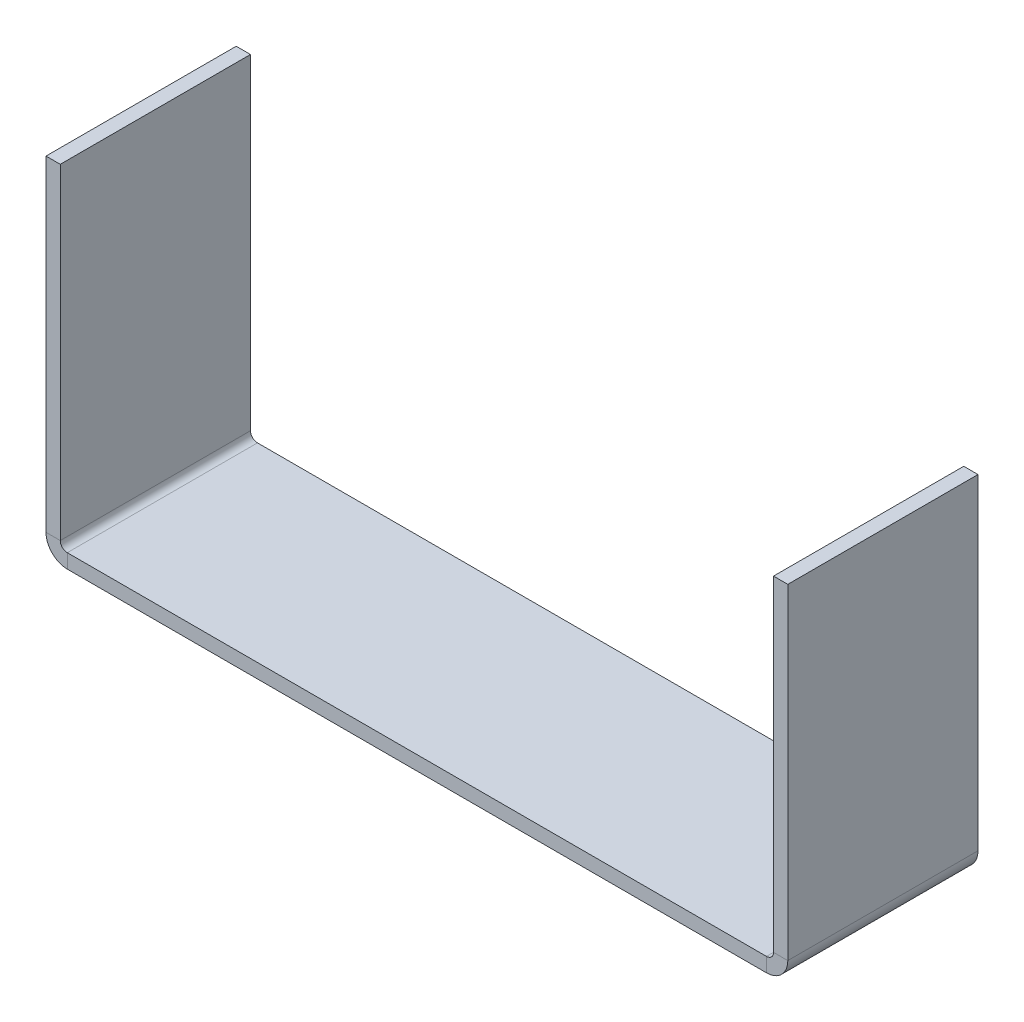
ISO-10303-21;
HEADER;
FILE_DESCRIPTION(('STEP AP214'),'2;1');
FILE_NAME('part.step','',(''),(''),'','','');
FILE_SCHEMA(('AUTOMOTIVE_DESIGN { 1 0 10303 214 1 1 1 1 }'));
ENDSEC;
DATA;
#1=APPLICATION_CONTEXT('core data for automotive mechanical design processes');
#2=APPLICATION_PROTOCOL_DEFINITION('international standard','automotive_design',2000,#1);
#3=PRODUCT_CONTEXT('',#1,'mechanical');
#4=PRODUCT('Part','Part','',(#3));
#5=PRODUCT_RELATED_PRODUCT_CATEGORY('part','',(#4));
#6=PRODUCT_DEFINITION_FORMATION('','',#4);
#7=PRODUCT_DEFINITION_CONTEXT('part definition',#1,'design');
#8=PRODUCT_DEFINITION('design','',#6,#7);
#9=PRODUCT_DEFINITION_SHAPE('','',#8);
#10=(LENGTH_UNIT() NAMED_UNIT(*) SI_UNIT(.MILLI.,.METRE.));
#11=(NAMED_UNIT(*) PLANE_ANGLE_UNIT() SI_UNIT($,.RADIAN.));
#12=(NAMED_UNIT(*) SI_UNIT($,.STERADIAN.) SOLID_ANGLE_UNIT());
#13=UNCERTAINTY_MEASURE_WITH_UNIT(LENGTH_MEASURE(1.E-05),#10,'distance_accuracy_value','');
#14=(GEOMETRIC_REPRESENTATION_CONTEXT(3) GLOBAL_UNCERTAINTY_ASSIGNED_CONTEXT((#13)) GLOBAL_UNIT_ASSIGNED_CONTEXT((#10,
#11,#12)) REPRESENTATION_CONTEXT('',''));
#15=CARTESIAN_POINT('',(0.,0.,0.));
#16=DIRECTION('',(0.,0.,1.));
#17=DIRECTION('',(1.,0.,0.));
#18=AXIS2_PLACEMENT_3D('',#15,#16,#17);
#19=CARTESIAN_POINT('',(0.,-1.5,0.));
#20=DIRECTION('',(0.,-1.,0.));
#21=DIRECTION('',(0.,0.,-1.));
#22=AXIS2_PLACEMENT_3D('',#19,#20,#21);
#23=PLANE('',#22);
#24=DIRECTION('',(-1.,0.,0.));
#25=VECTOR('',#24,1.);
#26=CARTESIAN_POINT('',(0.,-1.5,-20.));
#27=LINE('',#26,#25);
#28=CARTESIAN_POINT('',(75.7634,-1.5,-20.));
#29=VERTEX_POINT('',#28);
#30=CARTESIAN_POINT('',(2.2366,-1.5,-20.));
#31=VERTEX_POINT('',#30);
#32=EDGE_CURVE('E13',#29,#31,#27,.T.);
#33=ORIENTED_EDGE('',*,*,#32,.F.);
#34=DIRECTION('',(0.,0.,-1.));
#35=VECTOR('',#34,1.);
#36=CARTESIAN_POINT('',(75.7634,-1.5,-20.));
#37=LINE('',#36,#35);
#38=CARTESIAN_POINT('',(75.7634,-1.5,0.));
#39=VERTEX_POINT('',#38);
#40=EDGE_CURVE('E323',#29,#39,#37,.F.);
#41=ORIENTED_EDGE('',*,*,#40,.T.);
#42=DIRECTION('',(1.,0.,0.));
#43=VECTOR('',#42,1.);
#44=CARTESIAN_POINT('',(0.,-1.5,0.));
#45=LINE('',#44,#43);
#46=CARTESIAN_POINT('',(2.2366,-1.5,0.));
#47=VERTEX_POINT('',#46);
#48=EDGE_CURVE('E84',#47,#39,#45,.T.);
#49=ORIENTED_EDGE('',*,*,#48,.F.);
#50=DIRECTION('',(0.,0.,1.));
#51=VECTOR('',#50,1.);
#52=CARTESIAN_POINT('',(2.2366,-1.5,0.));
#53=LINE('',#52,#51);
#54=EDGE_CURVE('E98',#47,#31,#53,.F.);
#55=ORIENTED_EDGE('',*,*,#54,.T.);
#56=EDGE_LOOP('',(#33,#41,#49,#55));
#57=FACE_BOUND('',#56,.T.);
#58=ADVANCED_FACE('F75',(#57),#23,.T.);
#59=CARTESIAN_POINT('',(0.,0.,0.));
#60=DIRECTION('',(0.,-1.,0.));
#61=DIRECTION('',(0.,0.,-1.));
#62=AXIS2_PLACEMENT_3D('',#59,#60,#61);
#63=PLANE('',#62);
#64=DIRECTION('',(0.,0.,-1.));
#65=VECTOR('',#64,1.);
#66=CARTESIAN_POINT('',(75.7634,0.,-20.));
#67=LINE('',#66,#65);
#68=CARTESIAN_POINT('',(75.7634,0.,-20.));
#69=VERTEX_POINT('',#68);
#70=CARTESIAN_POINT('',(75.7634,0.,0.));
#71=VERTEX_POINT('',#70);
#72=EDGE_CURVE('E195',#69,#71,#67,.F.);
#73=ORIENTED_EDGE('',*,*,#72,.F.);
#74=DIRECTION('',(-1.,0.,0.));
#75=VECTOR('',#74,1.);
#76=CARTESIAN_POINT('',(0.,0.,-20.));
#77=LINE('',#76,#75);
#78=CARTESIAN_POINT('',(2.2366,0.,-20.));
#79=VERTEX_POINT('',#78);
#80=EDGE_CURVE('E79',#69,#79,#77,.T.);
#81=ORIENTED_EDGE('',*,*,#80,.T.);
#82=DIRECTION('',(0.,0.,1.));
#83=VECTOR('',#82,1.);
#84=CARTESIAN_POINT('',(2.2366,0.,0.));
#85=LINE('',#84,#83);
#86=CARTESIAN_POINT('',(2.2366,0.,0.));
#87=VERTEX_POINT('',#86);
#88=EDGE_CURVE('E142',#87,#79,#85,.F.);
#89=ORIENTED_EDGE('',*,*,#88,.F.);
#90=DIRECTION('',(1.,0.,0.));
#91=VECTOR('',#90,1.);
#92=CARTESIAN_POINT('',(0.,0.,0.));
#93=LINE('',#92,#91);
#94=EDGE_CURVE('E183',#87,#71,#93,.T.);
#95=ORIENTED_EDGE('',*,*,#94,.T.);
#96=EDGE_LOOP('',(#73,#81,#89,#95));
#97=FACE_BOUND('',#96,.T.);
#98=ADVANCED_FACE('F192',(#97),#63,.F.);
#99=CARTESIAN_POINT('',(0.,-1.5,-20.));
#100=DIRECTION('',(0.,0.,-1.));
#101=DIRECTION('',(-1.,0.,0.));
#102=AXIS2_PLACEMENT_3D('',#99,#100,#101);
#103=PLANE('',#102);
#104=ORIENTED_EDGE('',*,*,#80,.F.);
#105=DIRECTION('',(0.,-1.,0.));
#106=VECTOR('',#105,1.);
#107=CARTESIAN_POINT('',(75.7634,0.,-20.));
#108=LINE('',#107,#106);
#109=EDGE_CURVE('E329',#69,#29,#108,.T.);
#110=ORIENTED_EDGE('',*,*,#109,.T.);
#111=ORIENTED_EDGE('',*,*,#32,.T.);
#112=DIRECTION('',(0.,-1.,0.));
#113=VECTOR('',#112,1.);
#114=CARTESIAN_POINT('',(2.2366,0.,-20.));
#115=LINE('',#114,#113);
#116=EDGE_CURVE('E180',#79,#31,#115,.T.);
#117=ORIENTED_EDGE('',*,*,#116,.F.);
#118=EDGE_LOOP('',(#104,#110,#111,#117));
#119=FACE_BOUND('',#118,.T.);
#120=ADVANCED_FACE('F198',(#119),#103,.T.);
#121=CARTESIAN_POINT('',(0.,-1.5,0.));
#122=DIRECTION('',(0.,0.,1.));
#123=DIRECTION('',(1.,0.,0.));
#124=AXIS2_PLACEMENT_3D('',#121,#122,#123);
#125=PLANE('',#124);
#126=DIRECTION('',(0.,-1.,0.));
#127=VECTOR('',#126,1.);
#128=CARTESIAN_POINT('',(75.7634,0.,0.));
#129=LINE('',#128,#127);
#130=EDGE_CURVE('E171',#71,#39,#129,.T.);
#131=ORIENTED_EDGE('',*,*,#130,.F.);
#132=ORIENTED_EDGE('',*,*,#94,.F.);
#133=DIRECTION('',(0.,-1.,0.));
#134=VECTOR('',#133,1.);
#135=CARTESIAN_POINT('',(2.2366,0.,0.));
#136=LINE('',#135,#134);
#137=EDGE_CURVE('E141',#87,#47,#136,.T.);
#138=ORIENTED_EDGE('',*,*,#137,.T.);
#139=ORIENTED_EDGE('',*,*,#48,.T.);
#140=EDGE_LOOP('',(#131,#132,#138,#139));
#141=FACE_BOUND('',#140,.T.);
#142=ADVANCED_FACE('F77',(#141),#125,.T.);
#143=CARTESIAN_POINT('',(2.2366,0.7366,-20.));
#144=DIRECTION('',(0.,0.,-1.));
#145=DIRECTION('',(-1.,0.,0.));
#146=AXIS2_PLACEMENT_3D('',#143,#144,#145);
#147=PLANE('',#146);
#148=DIRECTION('',(1.,0.,0.));
#149=VECTOR('',#148,1.);
#150=CARTESIAN_POINT('',(0.,0.736599999999992,-20.));
#151=LINE('',#150,#149);
#152=CARTESIAN_POINT('',(1.5,0.736599999999997,-20.));
#153=VERTEX_POINT('',#152);
#154=CARTESIAN_POINT('',(0.,0.736599999999992,-20.));
#155=VERTEX_POINT('',#154);
#156=EDGE_CURVE('E132',#153,#155,#151,.F.);
#157=ORIENTED_EDGE('',*,*,#156,.F.);
#158=CARTESIAN_POINT('',(2.2366,0.7366,-20.));
#159=DIRECTION('',(0.,0.,1.));
#160=DIRECTION('',(1.,0.,0.));
#161=AXIS2_PLACEMENT_3D('',#158,#159,#160);
#162=CIRCLE('',#161,0.7366);
#163=EDGE_CURVE('E126',#79,#153,#162,.F.);
#164=ORIENTED_EDGE('',*,*,#163,.F.);
#165=ORIENTED_EDGE('',*,*,#116,.T.);
#166=CARTESIAN_POINT('',(2.2366,0.7366,-20.));
#167=DIRECTION('',(0.,0.,1.));
#168=DIRECTION('',(1.,0.,0.));
#169=AXIS2_PLACEMENT_3D('',#166,#167,#168);
#170=CIRCLE('',#169,2.2366);
#171=EDGE_CURVE('E173',#31,#155,#170,.F.);
#172=ORIENTED_EDGE('',*,*,#171,.T.);
#173=EDGE_LOOP('',(#157,#164,#165,#172));
#174=FACE_BOUND('',#173,.T.);
#175=ADVANCED_FACE('F197',(#174),#147,.T.);
#176=CARTESIAN_POINT('',(2.2366,0.7366,0.));
#177=DIRECTION('',(0.,0.,-1.));
#178=DIRECTION('',(-1.,0.,0.));
#179=AXIS2_PLACEMENT_3D('',#176,#177,#178);
#180=PLANE('',#179);
#181=CARTESIAN_POINT('',(2.2366,0.7366,0.));
#182=DIRECTION('',(0.,0.,1.));
#183=DIRECTION('',(1.,0.,0.));
#184=AXIS2_PLACEMENT_3D('',#181,#182,#183);
#185=CIRCLE('',#184,0.7366);
#186=CARTESIAN_POINT('',(1.5,0.736599999999997,0.));
#187=VERTEX_POINT('',#186);
#188=EDGE_CURVE('E123',#187,#87,#185,.T.);
#189=ORIENTED_EDGE('',*,*,#188,.F.);
#190=DIRECTION('',(1.,0.,0.));
#191=VECTOR('',#190,1.);
#192=CARTESIAN_POINT('',(1.5,0.736599999999997,0.));
#193=LINE('',#192,#191);
#194=CARTESIAN_POINT('',(0.,0.736599999999992,0.));
#195=VERTEX_POINT('',#194);
#196=EDGE_CURVE('E131',#187,#195,#193,.F.);
#197=ORIENTED_EDGE('',*,*,#196,.T.);
#198=CARTESIAN_POINT('',(2.2366,0.7366,0.));
#199=DIRECTION('',(0.,0.,1.));
#200=DIRECTION('',(1.,0.,0.));
#201=AXIS2_PLACEMENT_3D('',#198,#199,#200);
#202=CIRCLE('',#201,2.2366);
#203=EDGE_CURVE('E174',#195,#47,#202,.T.);
#204=ORIENTED_EDGE('',*,*,#203,.T.);
#205=ORIENTED_EDGE('',*,*,#137,.F.);
#206=EDGE_LOOP('',(#189,#197,#204,#205));
#207=FACE_BOUND('',#206,.T.);
#208=ADVANCED_FACE('F137',(#207),#180,.F.);
#209=CARTESIAN_POINT('',(2.2366,0.7366,0.));
#210=DIRECTION('',(0.,0.,1.));
#211=DIRECTION('',(-1.,0.,0.));
#212=AXIS2_PLACEMENT_3D('',#209,#210,#211);
#213=CYLINDRICAL_SURFACE('',#212,2.2366);
#214=ORIENTED_EDGE('',*,*,#54,.F.);
#215=ORIENTED_EDGE('',*,*,#203,.F.);
#216=DIRECTION('',(0.,0.,1.));
#217=VECTOR('',#216,1.);
#218=CARTESIAN_POINT('',(0.,0.736599999999992,-20.));
#219=LINE('',#218,#217);
#220=EDGE_CURVE('E155',#195,#155,#219,.F.);
#221=ORIENTED_EDGE('',*,*,#220,.T.);
#222=ORIENTED_EDGE('',*,*,#171,.F.);
#223=EDGE_LOOP('',(#214,#215,#221,#222));
#224=FACE_BOUND('',#223,.T.);
#225=ADVANCED_FACE('F214',(#224),#213,.T.);
#226=CARTESIAN_POINT('',(2.2366,0.7366,0.));
#227=DIRECTION('',(0.,0.,1.));
#228=DIRECTION('',(-1.,0.,0.));
#229=AXIS2_PLACEMENT_3D('',#226,#227,#228);
#230=CYLINDRICAL_SURFACE('',#229,0.7366);
#231=ORIENTED_EDGE('',*,*,#88,.T.);
#232=ORIENTED_EDGE('',*,*,#163,.T.);
#233=DIRECTION('',(0.,0.,1.));
#234=VECTOR('',#233,1.);
#235=CARTESIAN_POINT('',(1.5,0.736599999999997,-20.));
#236=LINE('',#235,#234);
#237=EDGE_CURVE('E119',#153,#187,#236,.T.);
#238=ORIENTED_EDGE('',*,*,#237,.T.);
#239=ORIENTED_EDGE('',*,*,#188,.T.);
#240=EDGE_LOOP('',(#231,#232,#238,#239));
#241=FACE_BOUND('',#240,.T.);
#242=ADVANCED_FACE('F122',(#241),#230,.F.);
#243=CARTESIAN_POINT('',(0.,0.,-20.));
#244=DIRECTION('',(0.,0.,1.));
#245=DIRECTION('',(1.,0.,0.));
#246=AXIS2_PLACEMENT_3D('',#243,#244,#245);
#247=PLANE('',#246);
#248=ORIENTED_EDGE('',*,*,#156,.T.);
#249=DIRECTION('',(0.,-1.,0.));
#250=VECTOR('',#249,1.);
#251=CARTESIAN_POINT('',(0.,0.,-20.));
#252=LINE('',#251,#250);
#253=CARTESIAN_POINT('',(-1.2220184685951E-13,35.,-20.));
#254=VERTEX_POINT('',#253);
#255=EDGE_CURVE('E163',#254,#155,#252,.T.);
#256=ORIENTED_EDGE('',*,*,#255,.F.);
#257=DIRECTION('',(1.,0.,0.));
#258=VECTOR('',#257,1.);
#259=CARTESIAN_POINT('',(-1.2220184685951E-13,35.,-20.));
#260=LINE('',#259,#258);
#261=CARTESIAN_POINT('',(1.49999999999988,35.,-20.));
#262=VERTEX_POINT('',#261);
#263=EDGE_CURVE('E343',#254,#262,#260,.T.);
#264=ORIENTED_EDGE('',*,*,#263,.T.);
#265=DIRECTION('',(0.,1.,0.));
#266=VECTOR('',#265,1.);
#267=CARTESIAN_POINT('',(1.5,0.,-20.));
#268=LINE('',#267,#266);
#269=EDGE_CURVE('E161',#262,#153,#268,.F.);
#270=ORIENTED_EDGE('',*,*,#269,.T.);
#271=EDGE_LOOP('',(#248,#256,#264,#270));
#272=FACE_BOUND('',#271,.T.);
#273=ADVANCED_FACE('F219',(#272),#247,.F.);
#274=CARTESIAN_POINT('',(-1.22298005056365E-13,35.,0.));
#275=DIRECTION('',(0.,0.,-1.));
#276=DIRECTION('',(-1.,0.,0.));
#277=AXIS2_PLACEMENT_3D('',#274,#275,#276);
#278=PLANE('',#277);
#279=ORIENTED_EDGE('',*,*,#196,.F.);
#280=DIRECTION('',(0.,-1.,0.));
#281=VECTOR('',#280,1.);
#282=CARTESIAN_POINT('',(1.49999999999988,35.,0.));
#283=LINE('',#282,#281);
#284=CARTESIAN_POINT('',(1.49999999999988,35.,0.));
#285=VERTEX_POINT('',#284);
#286=EDGE_CURVE('E151',#187,#285,#283,.F.);
#287=ORIENTED_EDGE('',*,*,#286,.T.);
#288=DIRECTION('',(1.,0.,0.));
#289=VECTOR('',#288,1.);
#290=CARTESIAN_POINT('',(-1.22298005056365E-13,35.,0.));
#291=LINE('',#290,#289);
#292=CARTESIAN_POINT('',(-1.2220184685951E-13,35.,0.));
#293=VERTEX_POINT('',#292);
#294=EDGE_CURVE('E143',#293,#285,#291,.T.);
#295=ORIENTED_EDGE('',*,*,#294,.F.);
#296=DIRECTION('',(0.,1.,0.));
#297=VECTOR('',#296,1.);
#298=CARTESIAN_POINT('',(0.,0.,0.));
#299=LINE('',#298,#297);
#300=EDGE_CURVE('E154',#195,#293,#299,.T.);
#301=ORIENTED_EDGE('',*,*,#300,.F.);
#302=EDGE_LOOP('',(#279,#287,#295,#301));
#303=FACE_BOUND('',#302,.T.);
#304=ADVANCED_FACE('F148',(#303),#278,.F.);
#305=CARTESIAN_POINT('',(0.,0.,0.));
#306=DIRECTION('',(1.,0.,0.));
#307=DIRECTION('',(0.,1.,0.));
#308=AXIS2_PLACEMENT_3D('',#305,#306,#307);
#309=PLANE('',#308);
#310=ORIENTED_EDGE('',*,*,#220,.F.);
#311=ORIENTED_EDGE('',*,*,#300,.T.);
#312=DIRECTION('',(0.,0.,-1.));
#313=VECTOR('',#312,1.);
#314=CARTESIAN_POINT('',(-1.2220184685951E-13,35.,0.));
#315=LINE('',#314,#313);
#316=EDGE_CURVE('E346',#293,#254,#315,.T.);
#317=ORIENTED_EDGE('',*,*,#316,.T.);
#318=ORIENTED_EDGE('',*,*,#255,.T.);
#319=EDGE_LOOP('',(#310,#311,#317,#318));
#320=FACE_BOUND('',#319,.T.);
#321=ADVANCED_FACE('F227',(#320),#309,.F.);
#322=CARTESIAN_POINT('',(1.5,0.,0.));
#323=DIRECTION('',(1.,0.,0.));
#324=DIRECTION('',(0.,1.,0.));
#325=AXIS2_PLACEMENT_3D('',#322,#323,#324);
#326=PLANE('',#325);
#327=ORIENTED_EDGE('',*,*,#286,.F.);
#328=ORIENTED_EDGE('',*,*,#237,.F.);
#329=ORIENTED_EDGE('',*,*,#269,.F.);
#330=DIRECTION('',(0.,0.,1.));
#331=VECTOR('',#330,1.);
#332=CARTESIAN_POINT('',(1.49999999999988,35.,-20.));
#333=LINE('',#332,#331);
#334=EDGE_CURVE('E160',#285,#262,#333,.F.);
#335=ORIENTED_EDGE('',*,*,#334,.F.);
#336=EDGE_LOOP('',(#327,#328,#329,#335));
#337=FACE_BOUND('',#336,.T.);
#338=ADVANCED_FACE('F158',(#337),#326,.T.);
#339=CARTESIAN_POINT('',(-1.22298005056365E-13,35.,-20.));
#340=DIRECTION('',(0.,-1.,0.));
#341=DIRECTION('',(1.,0.,0.));
#342=AXIS2_PLACEMENT_3D('',#339,#340,#341);
#343=PLANE('',#342);
#344=ORIENTED_EDGE('',*,*,#334,.T.);
#345=ORIENTED_EDGE('',*,*,#263,.F.);
#346=ORIENTED_EDGE('',*,*,#316,.F.);
#347=ORIENTED_EDGE('',*,*,#294,.T.);
#348=EDGE_LOOP('',(#344,#345,#346,#347));
#349=FACE_BOUND('',#348,.T.);
#350=ADVANCED_FACE('F228',(#349),#343,.F.);
#351=CARTESIAN_POINT('',(75.7634,0.736600000000006,0.));
#352=DIRECTION('',(0.,0.,1.));
#353=DIRECTION('',(1.,0.,0.));
#354=AXIS2_PLACEMENT_3D('',#351,#352,#353);
#355=PLANE('',#354);
#356=DIRECTION('',(-1.,0.,0.));
#357=VECTOR('',#356,1.);
#358=CARTESIAN_POINT('',(78.,0.736599999999999,0.));
#359=LINE('',#358,#357);
#360=CARTESIAN_POINT('',(76.5,0.736600000000004,0.));
#361=VERTEX_POINT('',#360);
#362=CARTESIAN_POINT('',(78.,0.736599999999998,0.));
#363=VERTEX_POINT('',#362);
#364=EDGE_CURVE('E320',#361,#363,#359,.F.);
#365=ORIENTED_EDGE('',*,*,#364,.F.);
#366=CARTESIAN_POINT('',(75.7634,0.736600000000006,0.));
#367=DIRECTION('',(0.,0.,-1.));
#368=DIRECTION('',(-1.,0.,0.));
#369=AXIS2_PLACEMENT_3D('',#366,#367,#368);
#370=CIRCLE('',#369,0.736600000000004);
#371=EDGE_CURVE('E332',#71,#361,#370,.F.);
#372=ORIENTED_EDGE('',*,*,#371,.F.);
#373=ORIENTED_EDGE('',*,*,#130,.T.);
#374=CARTESIAN_POINT('',(75.7634,0.736600000000006,0.));
#375=DIRECTION('',(0.,0.,-1.));
#376=DIRECTION('',(-1.,0.,0.));
#377=AXIS2_PLACEMENT_3D('',#374,#375,#376);
#378=CIRCLE('',#377,2.2366);
#379=EDGE_CURVE('E326',#39,#363,#378,.F.);
#380=ORIENTED_EDGE('',*,*,#379,.T.);
#381=EDGE_LOOP('',(#365,#372,#373,#380));
#382=FACE_BOUND('',#381,.T.);
#383=ADVANCED_FACE('F231',(#382),#355,.T.);
#384=CARTESIAN_POINT('',(75.7634,0.736600000000006,-20.));
#385=DIRECTION('',(0.,0.,1.));
#386=DIRECTION('',(1.,0.,0.));
#387=AXIS2_PLACEMENT_3D('',#384,#385,#386);
#388=PLANE('',#387);
#389=CARTESIAN_POINT('',(75.7634,0.736600000000006,-20.));
#390=DIRECTION('',(0.,0.,-1.));
#391=DIRECTION('',(-1.,0.,0.));
#392=AXIS2_PLACEMENT_3D('',#389,#390,#391);
#393=CIRCLE('',#392,0.736600000000004);
#394=CARTESIAN_POINT('',(76.5,0.736600000000004,-20.));
#395=VERTEX_POINT('',#394);
#396=EDGE_CURVE('E336',#395,#69,#393,.T.);
#397=ORIENTED_EDGE('',*,*,#396,.F.);
#398=DIRECTION('',(-1.,0.,0.));
#399=VECTOR('',#398,1.);
#400=CARTESIAN_POINT('',(76.5,0.736600000000004,-20.));
#401=LINE('',#400,#399);
#402=CARTESIAN_POINT('',(78.,0.736599999999999,-20.));
#403=VERTEX_POINT('',#402);
#404=EDGE_CURVE('E294',#395,#403,#401,.F.);
#405=ORIENTED_EDGE('',*,*,#404,.T.);
#406=CARTESIAN_POINT('',(75.7634,0.736600000000006,-20.));
#407=DIRECTION('',(0.,0.,-1.));
#408=DIRECTION('',(-1.,0.,0.));
#409=AXIS2_PLACEMENT_3D('',#406,#407,#408);
#410=CIRCLE('',#409,2.2366);
#411=EDGE_CURVE('E327',#403,#29,#410,.T.);
#412=ORIENTED_EDGE('',*,*,#411,.T.);
#413=ORIENTED_EDGE('',*,*,#109,.F.);
#414=EDGE_LOOP('',(#397,#405,#412,#413));
#415=FACE_BOUND('',#414,.T.);
#416=ADVANCED_FACE('F238',(#415),#388,.F.);
#417=CARTESIAN_POINT('',(75.7634,0.736600000000006,-20.));
#418=DIRECTION('',(0.,0.,-1.));
#419=DIRECTION('',(1.,0.,0.));
#420=AXIS2_PLACEMENT_3D('',#417,#418,#419);
#421=CYLINDRICAL_SURFACE('',#420,2.2366);
#422=ORIENTED_EDGE('',*,*,#40,.F.);
#423=ORIENTED_EDGE('',*,*,#411,.F.);
#424=DIRECTION('',(0.,0.,-1.));
#425=VECTOR('',#424,1.);
#426=CARTESIAN_POINT('',(78.,0.736599999999999,0.));
#427=LINE('',#426,#425);
#428=EDGE_CURVE('E279',#403,#363,#427,.F.);
#429=ORIENTED_EDGE('',*,*,#428,.T.);
#430=ORIENTED_EDGE('',*,*,#379,.F.);
#431=EDGE_LOOP('',(#422,#423,#429,#430));
#432=FACE_BOUND('',#431,.T.);
#433=ADVANCED_FACE('F241',(#432),#421,.T.);
#434=CARTESIAN_POINT('',(75.7634,0.736600000000006,-20.));
#435=DIRECTION('',(0.,0.,-1.));
#436=DIRECTION('',(1.,0.,0.));
#437=AXIS2_PLACEMENT_3D('',#434,#435,#436);
#438=CYLINDRICAL_SURFACE('',#437,0.736600000000004);
#439=ORIENTED_EDGE('',*,*,#72,.T.);
#440=ORIENTED_EDGE('',*,*,#371,.T.);
#441=DIRECTION('',(0.,0.,-1.));
#442=VECTOR('',#441,1.);
#443=CARTESIAN_POINT('',(76.5,0.736600000000004,0.));
#444=LINE('',#443,#442);
#445=EDGE_CURVE('E317',#361,#395,#444,.T.);
#446=ORIENTED_EDGE('',*,*,#445,.T.);
#447=ORIENTED_EDGE('',*,*,#396,.T.);
#448=EDGE_LOOP('',(#439,#440,#446,#447));
#449=FACE_BOUND('',#448,.T.);
#450=ADVANCED_FACE('F246',(#449),#438,.F.);
#451=CARTESIAN_POINT('',(78.0000000000001,35.,-20.));
#452=DIRECTION('',(0.,0.,1.));
#453=DIRECTION('',(1.,0.,0.));
#454=AXIS2_PLACEMENT_3D('',#451,#452,#453);
#455=PLANE('',#454);
#456=ORIENTED_EDGE('',*,*,#404,.F.);
#457=DIRECTION('',(0.,-1.,0.));
#458=VECTOR('',#457,1.);
#459=CARTESIAN_POINT('',(76.5000000000001,35.,-20.));
#460=LINE('',#459,#458);
#461=CARTESIAN_POINT('',(76.5000000000001,35.,-20.));
#462=VERTEX_POINT('',#461);
#463=EDGE_CURVE('E293',#395,#462,#460,.F.);
#464=ORIENTED_EDGE('',*,*,#463,.T.);
#465=DIRECTION('',(-1.,0.,0.));
#466=VECTOR('',#465,1.);
#467=CARTESIAN_POINT('',(78.0000000000001,35.,-20.));
#468=LINE('',#467,#466);
#469=CARTESIAN_POINT('',(78.0000000000001,35.,-20.));
#470=VERTEX_POINT('',#469);
#471=EDGE_CURVE('E302',#470,#462,#468,.T.);
#472=ORIENTED_EDGE('',*,*,#471,.F.);
#473=DIRECTION('',(0.,1.,0.));
#474=VECTOR('',#473,1.);
#475=CARTESIAN_POINT('',(78.,-2.83585994610715E-13,-20.));
#476=LINE('',#475,#474);
#477=EDGE_CURVE('E283',#403,#470,#476,.T.);
#478=ORIENTED_EDGE('',*,*,#477,.F.);
#479=EDGE_LOOP('',(#456,#464,#472,#478));
#480=FACE_BOUND('',#479,.T.);
#481=ADVANCED_FACE('F249',(#480),#455,.F.);
#482=CARTESIAN_POINT('',(78.,0.,0.));
#483=DIRECTION('',(0.,0.,-1.));
#484=DIRECTION('',(-1.,0.,0.));
#485=AXIS2_PLACEMENT_3D('',#482,#483,#484);
#486=PLANE('',#485);
#487=ORIENTED_EDGE('',*,*,#364,.T.);
#488=DIRECTION('',(0.,-1.,0.));
#489=VECTOR('',#488,1.);
#490=CARTESIAN_POINT('',(78.,-2.83585994610715E-13,0.));
#491=LINE('',#490,#489);
#492=CARTESIAN_POINT('',(78.0000000000001,35.,0.));
#493=VERTEX_POINT('',#492);
#494=EDGE_CURVE('E287',#493,#363,#491,.T.);
#495=ORIENTED_EDGE('',*,*,#494,.F.);
#496=DIRECTION('',(-1.,0.,0.));
#497=VECTOR('',#496,1.);
#498=CARTESIAN_POINT('',(78.0000000000001,35.,0.));
#499=LINE('',#498,#497);
#500=CARTESIAN_POINT('',(76.5000000000001,35.,0.));
#501=VERTEX_POINT('',#500);
#502=EDGE_CURVE('E382',#493,#501,#499,.T.);
#503=ORIENTED_EDGE('',*,*,#502,.T.);
#504=DIRECTION('',(0.,1.,0.));
#505=VECTOR('',#504,1.);
#506=CARTESIAN_POINT('',(76.5,0.,0.));
#507=LINE('',#506,#505);
#508=EDGE_CURVE('E305',#501,#361,#507,.F.);
#509=ORIENTED_EDGE('',*,*,#508,.T.);
#510=EDGE_LOOP('',(#487,#495,#503,#509));
#511=FACE_BOUND('',#510,.T.);
#512=ADVANCED_FACE('F256',(#511),#486,.F.);
#513=CARTESIAN_POINT('',(78.,-2.83585994610715E-13,0.));
#514=DIRECTION('',(-1.,0.,0.));
#515=DIRECTION('',(0.,-1.,0.));
#516=AXIS2_PLACEMENT_3D('',#513,#514,#515);
#517=PLANE('',#516);
#518=ORIENTED_EDGE('',*,*,#428,.F.);
#519=ORIENTED_EDGE('',*,*,#477,.T.);
#520=DIRECTION('',(0.,0.,1.));
#521=VECTOR('',#520,1.);
#522=CARTESIAN_POINT('',(78.0000000000001,35.,0.));
#523=LINE('',#522,#521);
#524=EDGE_CURVE('E304',#470,#493,#523,.T.);
#525=ORIENTED_EDGE('',*,*,#524,.T.);
#526=ORIENTED_EDGE('',*,*,#494,.T.);
#527=EDGE_LOOP('',(#518,#519,#525,#526));
#528=FACE_BOUND('',#527,.T.);
#529=ADVANCED_FACE('F265',(#528),#517,.F.);
#530=CARTESIAN_POINT('',(76.5,-2.7834877260245E-13,0.));
#531=DIRECTION('',(-1.,0.,0.));
#532=DIRECTION('',(0.,-1.,0.));
#533=AXIS2_PLACEMENT_3D('',#530,#531,#532);
#534=PLANE('',#533);
#535=ORIENTED_EDGE('',*,*,#463,.F.);
#536=ORIENTED_EDGE('',*,*,#445,.F.);
#537=ORIENTED_EDGE('',*,*,#508,.F.);
#538=DIRECTION('',(0.,0.,-1.));
#539=VECTOR('',#538,1.);
#540=CARTESIAN_POINT('',(76.5000000000001,35.,0.));
#541=LINE('',#540,#539);
#542=EDGE_CURVE('E309',#462,#501,#541,.F.);
#543=ORIENTED_EDGE('',*,*,#542,.F.);
#544=EDGE_LOOP('',(#535,#536,#537,#543));
#545=FACE_BOUND('',#544,.T.);
#546=ADVANCED_FACE('F261',(#545),#534,.T.);
#547=CARTESIAN_POINT('',(78.0000000000001,35.,0.));
#548=DIRECTION('',(0.,-1.,0.));
#549=DIRECTION('',(1.,0.,0.));
#550=AXIS2_PLACEMENT_3D('',#547,#548,#549);
#551=PLANE('',#550);
#552=ORIENTED_EDGE('',*,*,#542,.T.);
#553=ORIENTED_EDGE('',*,*,#502,.F.);
#554=ORIENTED_EDGE('',*,*,#524,.F.);
#555=ORIENTED_EDGE('',*,*,#471,.T.);
#556=EDGE_LOOP('',(#552,#553,#554,#555));
#557=FACE_BOUND('',#556,.T.);
#558=ADVANCED_FACE('F258',(#557),#551,.F.);
#559=CLOSED_SHELL('',(#58,#98,#120,#142,#175,#208,#225,#242,#273,#304,#321,#338,#350,#383,#416,
#433,#450,#481,#512,#529,#546,#558));
#560=MANIFOLD_SOLID_BREP('B2',#559);
#561=ADVANCED_BREP_SHAPE_REPRESENTATION('',(#18,#560),#14);
#562=SHAPE_DEFINITION_REPRESENTATION(#9,#561);
ENDSEC;
END-ISO-10303-21;
